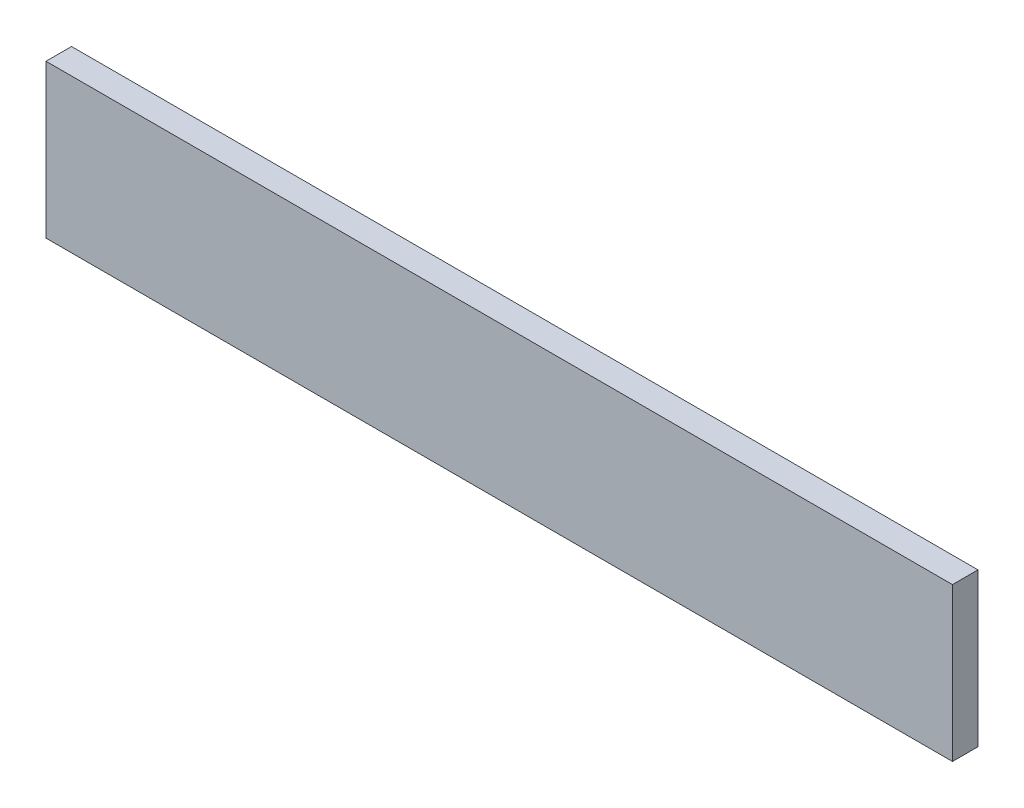
ISO-10303-21;
HEADER;
FILE_DESCRIPTION(('STEP AP214'),'2;1');
FILE_NAME('part.step','',(''),(''),'','','');
FILE_SCHEMA(('AUTOMOTIVE_DESIGN { 1 0 10303 214 1 1 1 1 }'));
ENDSEC;
DATA;
#1=APPLICATION_CONTEXT('core data for automotive mechanical design processes');
#2=APPLICATION_PROTOCOL_DEFINITION('international standard','automotive_design',2000,#1);
#3=PRODUCT_CONTEXT('',#1,'mechanical');
#4=PRODUCT('Part','Part','',(#3));
#5=PRODUCT_RELATED_PRODUCT_CATEGORY('part','',(#4));
#6=PRODUCT_DEFINITION_FORMATION('','',#4);
#7=PRODUCT_DEFINITION_CONTEXT('part definition',#1,'design');
#8=PRODUCT_DEFINITION('design','',#6,#7);
#9=PRODUCT_DEFINITION_SHAPE('','',#8);
#10=(LENGTH_UNIT() NAMED_UNIT(*) SI_UNIT(.MILLI.,.METRE.));
#11=(NAMED_UNIT(*) PLANE_ANGLE_UNIT() SI_UNIT($,.RADIAN.));
#12=(NAMED_UNIT(*) SI_UNIT($,.STERADIAN.) SOLID_ANGLE_UNIT());
#13=UNCERTAINTY_MEASURE_WITH_UNIT(LENGTH_MEASURE(1.E-05),#10,'distance_accuracy_value','');
#14=(GEOMETRIC_REPRESENTATION_CONTEXT(3) GLOBAL_UNCERTAINTY_ASSIGNED_CONTEXT((#13)) GLOBAL_UNIT_ASSIGNED_CONTEXT((#10,
#11,#12)) REPRESENTATION_CONTEXT('',''));
#15=CARTESIAN_POINT('',(0.,0.,0.));
#16=DIRECTION('',(0.,0.,1.));
#17=DIRECTION('',(1.,0.,0.));
#18=AXIS2_PLACEMENT_3D('',#15,#16,#17);
#19=CARTESIAN_POINT('',(0.,0.,20.));
#20=DIRECTION('',(1.,0.,0.));
#21=DIRECTION('',(0.,0.,-1.));
#22=AXIS2_PLACEMENT_3D('',#19,#20,#21);
#23=PLANE('',#22);
#24=DIRECTION('',(0.,-1.,0.));
#25=VECTOR('',#24,1.);
#26=CARTESIAN_POINT('',(0.,0.,0.));
#27=LINE('',#26,#25);
#28=CARTESIAN_POINT('',(0.,120.,0.));
#29=VERTEX_POINT('',#28);
#30=CARTESIAN_POINT('',(0.,0.,0.));
#31=VERTEX_POINT('',#30);
#32=EDGE_CURVE('E103',#29,#31,#27,.T.);
#33=ORIENTED_EDGE('',*,*,#32,.T.);
#34=DIRECTION('',(0.,0.,-1.));
#35=VECTOR('',#34,1.);
#36=CARTESIAN_POINT('',(0.,0.,20.));
#37=LINE('',#36,#35);
#38=CARTESIAN_POINT('',(0.,0.,20.));
#39=VERTEX_POINT('',#38);
#40=EDGE_CURVE('E11',#39,#31,#37,.T.);
#41=ORIENTED_EDGE('',*,*,#40,.F.);
#42=DIRECTION('',(0.,-1.,0.));
#43=VECTOR('',#42,1.);
#44=CARTESIAN_POINT('',(0.,0.,20.));
#45=LINE('',#44,#43);
#46=CARTESIAN_POINT('',(0.,120.,20.));
#47=VERTEX_POINT('',#46);
#48=EDGE_CURVE('E93',#47,#39,#45,.T.);
#49=ORIENTED_EDGE('',*,*,#48,.F.);
#50=DIRECTION('',(0.,0.,-1.));
#51=VECTOR('',#50,1.);
#52=CARTESIAN_POINT('',(0.,120.,20.));
#53=LINE('',#52,#51);
#54=EDGE_CURVE('E97',#47,#29,#53,.T.);
#55=ORIENTED_EDGE('',*,*,#54,.T.);
#56=EDGE_LOOP('',(#33,#41,#49,#55));
#57=FACE_BOUND('',#56,.T.);
#58=ADVANCED_FACE('F37',(#57),#23,.F.);
#59=CARTESIAN_POINT('',(0.,0.,20.));
#60=DIRECTION('',(0.,1.,0.));
#61=DIRECTION('',(0.,0.,1.));
#62=AXIS2_PLACEMENT_3D('',#59,#60,#61);
#63=PLANE('',#62);
#64=DIRECTION('',(1.,0.,0.));
#65=VECTOR('',#64,1.);
#66=CARTESIAN_POINT('',(0.,0.,0.));
#67=LINE('',#66,#65);
#68=CARTESIAN_POINT('',(710.,0.,0.));
#69=VERTEX_POINT('',#68);
#70=EDGE_CURVE('E92',#31,#69,#67,.T.);
#71=ORIENTED_EDGE('',*,*,#70,.T.);
#72=DIRECTION('',(0.,0.,-1.));
#73=VECTOR('',#72,1.);
#74=CARTESIAN_POINT('',(710.,0.,20.));
#75=LINE('',#74,#73);
#76=CARTESIAN_POINT('',(710.,0.,20.));
#77=VERTEX_POINT('',#76);
#78=EDGE_CURVE('E48',#77,#69,#75,.T.);
#79=ORIENTED_EDGE('',*,*,#78,.F.);
#80=DIRECTION('',(1.,0.,0.));
#81=VECTOR('',#80,1.);
#82=CARTESIAN_POINT('',(0.,0.,20.));
#83=LINE('',#82,#81);
#84=EDGE_CURVE('E88',#39,#77,#83,.T.);
#85=ORIENTED_EDGE('',*,*,#84,.F.);
#86=ORIENTED_EDGE('',*,*,#40,.T.);
#87=EDGE_LOOP('',(#71,#79,#85,#86));
#88=FACE_BOUND('',#87,.T.);
#89=ADVANCED_FACE('F94',(#88),#63,.F.);
#90=CARTESIAN_POINT('',(710.,0.,20.));
#91=DIRECTION('',(-1.,0.,0.));
#92=DIRECTION('',(0.,0.,1.));
#93=AXIS2_PLACEMENT_3D('',#90,#91,#92);
#94=PLANE('',#93);
#95=DIRECTION('',(0.,1.,0.));
#96=VECTOR('',#95,1.);
#97=CARTESIAN_POINT('',(710.,0.,0.));
#98=LINE('',#97,#96);
#99=CARTESIAN_POINT('',(710.,120.,0.));
#100=VERTEX_POINT('',#99);
#101=EDGE_CURVE('E71',#69,#100,#98,.T.);
#102=ORIENTED_EDGE('',*,*,#101,.T.);
#103=DIRECTION('',(0.,0.,-1.));
#104=VECTOR('',#103,1.);
#105=CARTESIAN_POINT('',(710.,120.,20.));
#106=LINE('',#105,#104);
#107=CARTESIAN_POINT('',(710.,120.,20.));
#108=VERTEX_POINT('',#107);
#109=EDGE_CURVE('E96',#108,#100,#106,.T.);
#110=ORIENTED_EDGE('',*,*,#109,.F.);
#111=DIRECTION('',(0.,1.,0.));
#112=VECTOR('',#111,1.);
#113=CARTESIAN_POINT('',(710.,0.,20.));
#114=LINE('',#113,#112);
#115=EDGE_CURVE('E90',#77,#108,#114,.T.);
#116=ORIENTED_EDGE('',*,*,#115,.F.);
#117=ORIENTED_EDGE('',*,*,#78,.T.);
#118=EDGE_LOOP('',(#102,#110,#116,#117));
#119=FACE_BOUND('',#118,.T.);
#120=ADVANCED_FACE('F100',(#119),#94,.F.);
#121=CARTESIAN_POINT('',(0.,120.,20.));
#122=DIRECTION('',(0.,-1.,0.));
#123=DIRECTION('',(0.,0.,-1.));
#124=AXIS2_PLACEMENT_3D('',#121,#122,#123);
#125=PLANE('',#124);
#126=DIRECTION('',(-1.,0.,0.));
#127=VECTOR('',#126,1.);
#128=CARTESIAN_POINT('',(0.,120.,0.));
#129=LINE('',#128,#127);
#130=EDGE_CURVE('E76',#100,#29,#129,.T.);
#131=ORIENTED_EDGE('',*,*,#130,.T.);
#132=ORIENTED_EDGE('',*,*,#54,.F.);
#133=DIRECTION('',(-1.,0.,0.));
#134=VECTOR('',#133,1.);
#135=CARTESIAN_POINT('',(0.,120.,20.));
#136=LINE('',#135,#134);
#137=EDGE_CURVE('E57',#108,#47,#136,.T.);
#138=ORIENTED_EDGE('',*,*,#137,.F.);
#139=ORIENTED_EDGE('',*,*,#109,.T.);
#140=EDGE_LOOP('',(#131,#132,#138,#139));
#141=FACE_BOUND('',#140,.T.);
#142=ADVANCED_FACE('F109',(#141),#125,.F.);
#143=CARTESIAN_POINT('',(0.,0.,20.));
#144=DIRECTION('',(0.,0.,-1.));
#145=DIRECTION('',(-1.,0.,0.));
#146=AXIS2_PLACEMENT_3D('',#143,#144,#145);
#147=PLANE('',#146);
#148=ORIENTED_EDGE('',*,*,#48,.T.);
#149=ORIENTED_EDGE('',*,*,#84,.T.);
#150=ORIENTED_EDGE('',*,*,#115,.T.);
#151=ORIENTED_EDGE('',*,*,#137,.T.);
#152=EDGE_LOOP('',(#148,#149,#150,#151));
#153=FACE_BOUND('',#152,.T.);
#154=ADVANCED_FACE('F87',(#153),#147,.F.);
#155=CARTESIAN_POINT('',(0.,0.,0.));
#156=DIRECTION('',(0.,0.,-1.));
#157=DIRECTION('',(-1.,0.,0.));
#158=AXIS2_PLACEMENT_3D('',#155,#156,#157);
#159=PLANE('',#158);
#160=ORIENTED_EDGE('',*,*,#32,.F.);
#161=ORIENTED_EDGE('',*,*,#130,.F.);
#162=ORIENTED_EDGE('',*,*,#101,.F.);
#163=ORIENTED_EDGE('',*,*,#70,.F.);
#164=EDGE_LOOP('',(#160,#161,#162,#163));
#165=FACE_BOUND('',#164,.T.);
#166=ADVANCED_FACE('F114',(#165),#159,.T.);
#167=CLOSED_SHELL('',(#58,#89,#120,#142,#154,#166));
#168=MANIFOLD_SOLID_BREP('B2',#167);
#169=ADVANCED_BREP_SHAPE_REPRESENTATION('',(#18,#168),#14);
#170=SHAPE_DEFINITION_REPRESENTATION(#9,#169);
ENDSEC;
END-ISO-10303-21;
